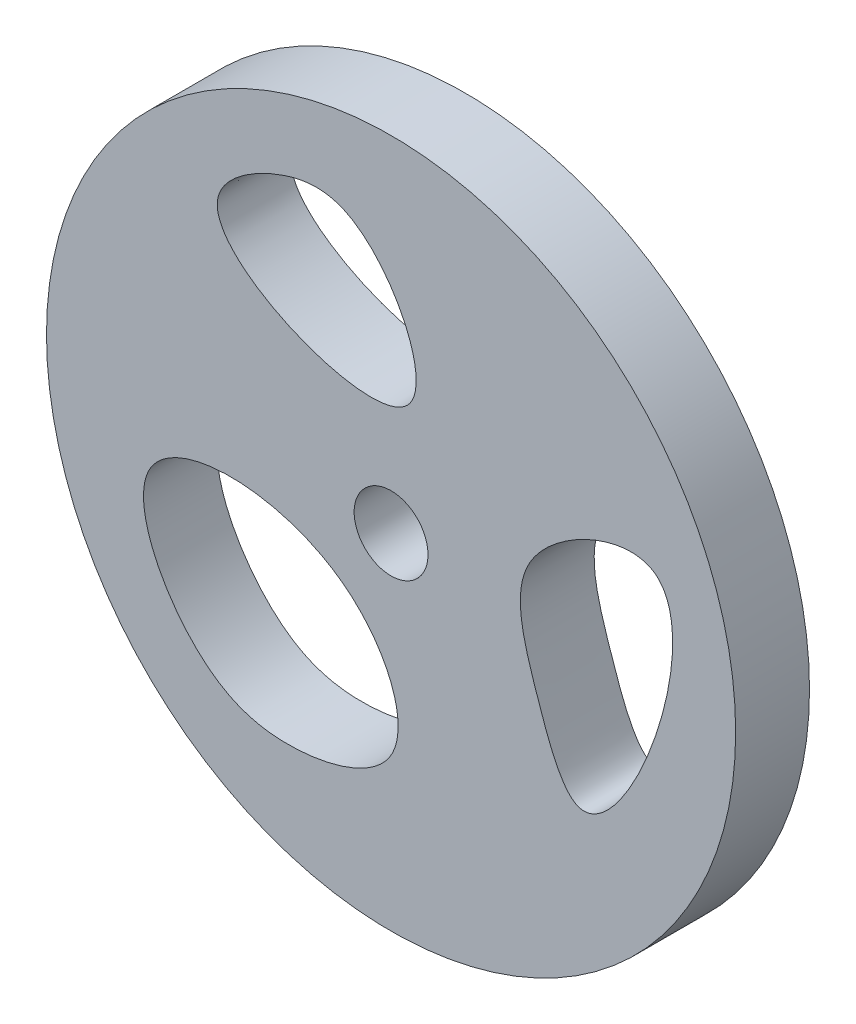
ISO-10303-21;
HEADER;
FILE_DESCRIPTION(('STEP AP214'),'2;1');
FILE_NAME('part.step','',(''),(''),'','','');
FILE_SCHEMA(('AUTOMOTIVE_DESIGN { 1 0 10303 214 1 1 1 1 }'));
ENDSEC;
DATA;
#1=APPLICATION_CONTEXT('core data for automotive mechanical design processes');
#2=APPLICATION_PROTOCOL_DEFINITION('international standard','automotive_design',2000,#1);
#3=PRODUCT_CONTEXT('',#1,'mechanical');
#4=PRODUCT('Part','Part','',(#3));
#5=PRODUCT_RELATED_PRODUCT_CATEGORY('part','',(#4));
#6=PRODUCT_DEFINITION_FORMATION('','',#4);
#7=PRODUCT_DEFINITION_CONTEXT('part definition',#1,'design');
#8=PRODUCT_DEFINITION('design','',#6,#7);
#9=PRODUCT_DEFINITION_SHAPE('','',#8);
#10=(LENGTH_UNIT() NAMED_UNIT(*) SI_UNIT(.MILLI.,.METRE.));
#11=(NAMED_UNIT(*) PLANE_ANGLE_UNIT() SI_UNIT($,.RADIAN.));
#12=(NAMED_UNIT(*) SI_UNIT($,.STERADIAN.) SOLID_ANGLE_UNIT());
#13=UNCERTAINTY_MEASURE_WITH_UNIT(LENGTH_MEASURE(1.E-05),#10,'distance_accuracy_value','');
#14=(GEOMETRIC_REPRESENTATION_CONTEXT(3) GLOBAL_UNCERTAINTY_ASSIGNED_CONTEXT((#13)) GLOBAL_UNIT_ASSIGNED_CONTEXT((#10,
#11,#12)) REPRESENTATION_CONTEXT('',''));
#15=CARTESIAN_POINT('',(0.,0.,0.));
#16=DIRECTION('',(0.,0.,1.));
#17=DIRECTION('',(1.,0.,0.));
#18=AXIS2_PLACEMENT_3D('',#15,#16,#17);
#19=CARTESIAN_POINT('',(-1.24613143731576,-2.4276660944202,24.0005031594472));
#20=DIRECTION('',(0.,0.,1.));
#21=DIRECTION('',(1.,0.,0.));
#22=AXIS2_PLACEMENT_3D('',#19,#20,#21);
#23=PLANE('',#22);
#24=CARTESIAN_POINT('',(-139.433181797028,-41.2046445116864,24.0005031594472));
#25=CARTESIAN_POINT('',(-149.994161996427,-64.3151862714933,24.0005031594472));
#26=CARTESIAN_POINT('',(-116.966744713604,-124.5967057877,24.0005031594472));
#27=CARTESIAN_POINT('',(-55.692370103751,-140.744086820099,24.0005031594472));
#28=CARTESIAN_POINT('',(21.3017568928945,-119.829199606839,24.0005031594472));
#29=CARTESIAN_POINT('',(-22.6836745113519,-13.0135413415076,24.0005031594472));
#30=CARTESIAN_POINT('',(-126.657861366658,-13.2484727618535,24.0005031594472));
#31=CARTESIAN_POINT('',(-139.433181797028,-41.2046445116864,24.0005031594472));
#32=B_SPLINE_CURVE_WITH_KNOTS('',3,(#24,#25,#26,#27,#28,#29,#30,#31),.UNSPECIFIED.,.T.,.F.,(4,1,
1,1,1,4),(0.,0.239927974387723,0.343384517625706,0.513257855397015,0.709765883929295,1.),.UNSPECIFIED.);
#33=CARTESIAN_POINT('',(-139.433181797028,-41.2046445116864,24.0005031594472));
#34=VERTEX_POINT('',#33);
#35=EDGE_CURVE('E65',#34,#34,#32,.T.);
#36=ORIENTED_EDGE('',*,*,#35,.F.);
#37=EDGE_LOOP('',(#36));
#38=FACE_BOUND('',#37,.T.);
#39=CARTESIAN_POINT('',(-1.24613143731576,-2.4276660944202,24.0005031594472));
#40=DIRECTION('',(0.,0.,1.));
#41=DIRECTION('',(1.,0.,0.));
#42=AXIS2_PLACEMENT_3D('',#39,#40,#41);
#43=CIRCLE('',#42,21.);
#44=CARTESIAN_POINT('',(19.7538685626842,-2.4276660944202,24.0005031594472));
#45=VERTEX_POINT('',#44);
#46=EDGE_CURVE('E49',#45,#45,#43,.T.);
#47=ORIENTED_EDGE('',*,*,#46,.F.);
#48=EDGE_LOOP('',(#47));
#49=FACE_BOUND('',#48,.T.);
#50=CARTESIAN_POINT('',(-1.24613143731576,-2.4276660944202,24.0005031594472));
#51=DIRECTION('',(0.,0.,1.));
#52=DIRECTION('',(1.,0.,0.));
#53=AXIS2_PLACEMENT_3D('',#50,#51,#52);
#54=CIRCLE('',#53,196.);
#55=CARTESIAN_POINT('',(194.753868562684,-2.4276660944202,24.0005031594472));
#56=VERTEX_POINT('',#55);
#57=EDGE_CURVE('E10',#56,#56,#54,.T.);
#58=ORIENTED_EDGE('',*,*,#57,.T.);
#59=EDGE_LOOP('',(#58));
#60=FACE_BOUND('',#59,.T.);
#61=CARTESIAN_POINT('',(-61.8792249624956,143.514779948745,24.0005031594472));
#62=CARTESIAN_POINT('',(-79.186551992522,137.811286734839,24.0005031594472));
#63=CARTESIAN_POINT('',(-143.331388537893,96.4885523439587,24.0005031594472));
#64=CARTESIAN_POINT('',(56.2735263084702,15.5704714193278,24.0005031594472));
#65=CARTESIAN_POINT('',(-10.3617333875224,150.542872956365,24.0005031594472));
#66=CARTESIAN_POINT('',(-49.9527845896374,147.445044374595,24.0005031594472));
#67=CARTESIAN_POINT('',(-61.8792249624956,143.514779948745,24.0005031594472));
#68=B_SPLINE_CURVE_WITH_KNOTS('',3,(#61,#62,#63,#64,#65,#66,#67),.UNSPECIFIED.,.T.,.F.,(4,1,1,1,
4),(0.,0.171198278631657,0.582988164100116,0.882027648839468,1.),.UNSPECIFIED.);
#69=CARTESIAN_POINT('',(-61.8792249624956,143.514779948745,24.0005031594472));
#70=VERTEX_POINT('',#69);
#71=EDGE_CURVE('E55',#70,#70,#68,.T.);
#72=ORIENTED_EDGE('',*,*,#71,.F.);
#73=EDGE_LOOP('',(#72));
#74=FACE_BOUND('',#73,.T.);
#75=CARTESIAN_POINT('',(148.221494461965,53.2701756321986,24.0005031594472));
#76=CARTESIAN_POINT('',(131.507299926172,64.3295465026712,24.0005031594472));
#77=CARTESIAN_POINT('',(59.0576414772064,30.7257981379264,24.0005031594472));
#78=CARTESIAN_POINT('',(78.3099850439555,-31.9013091478238,24.0005031594472));
#79=CARTESIAN_POINT('',(116.403289468822,-138.864569313652,24.0005031594472));
#80=CARTESIAN_POINT('',(180.381660063077,31.9905861265931,24.0005031594472));
#81=CARTESIAN_POINT('',(148.221494461965,53.2701756321986,24.0005031594472));
#82=B_SPLINE_CURVE_WITH_KNOTS('',3,(#75,#76,#77,#78,#79,#80,#81),.UNSPECIFIED.,.T.,.F.,(4,1,1,1,
4),(0.,0.224446261208132,0.423947927755001,0.56813779368511,1.),.UNSPECIFIED.);
#83=CARTESIAN_POINT('',(148.221494461965,53.2701756321986,24.0005031594472));
#84=VERTEX_POINT('',#83);
#85=EDGE_CURVE('E117',#84,#84,#82,.T.);
#86=ORIENTED_EDGE('',*,*,#85,.F.);
#87=EDGE_LOOP('',(#86));
#88=FACE_BOUND('',#87,.T.);
#89=ADVANCED_FACE('F36',(#38,#49,#60,#74,#88),#23,.T.);
#90=CARTESIAN_POINT('',(-1.24613143731576,-2.4276660944202,-17.9994968405528));
#91=DIRECTION('',(0.,0.,1.));
#92=DIRECTION('',(1.,0.,0.));
#93=AXIS2_PLACEMENT_3D('',#90,#91,#92);
#94=PLANE('',#93);
#95=CARTESIAN_POINT('',(-1.24613143731576,-2.4276660944202,-17.9994968405528));
#96=DIRECTION('',(0.,0.,1.));
#97=DIRECTION('',(1.,0.,0.));
#98=AXIS2_PLACEMENT_3D('',#95,#96,#97);
#99=CIRCLE('',#98,196.);
#100=CARTESIAN_POINT('',(194.753868562684,-2.4276660944202,-17.9994968405528));
#101=VERTEX_POINT('',#100);
#102=EDGE_CURVE('E40',#101,#101,#99,.T.);
#103=ORIENTED_EDGE('',*,*,#102,.F.);
#104=EDGE_LOOP('',(#103));
#105=FACE_BOUND('',#104,.T.);
#106=CARTESIAN_POINT('',(-1.24613143731576,-2.4276660944202,-17.9994968405528));
#107=DIRECTION('',(0.,0.,1.));
#108=DIRECTION('',(1.,0.,0.));
#109=AXIS2_PLACEMENT_3D('',#106,#107,#108);
#110=CIRCLE('',#109,21.);
#111=CARTESIAN_POINT('',(19.7538685626842,-2.4276660944202,-17.9994968405528));
#112=VERTEX_POINT('',#111);
#113=EDGE_CURVE('E51',#112,#112,#110,.T.);
#114=ORIENTED_EDGE('',*,*,#113,.T.);
#115=EDGE_LOOP('',(#114));
#116=FACE_BOUND('',#115,.T.);
#117=CARTESIAN_POINT('',(-61.8792249624956,143.514779948745,-17.9994968405528));
#118=CARTESIAN_POINT('',(-79.186551992522,137.811286734839,-17.9994968405528));
#119=CARTESIAN_POINT('',(-143.331388537893,96.4885523439587,-17.9994968405528));
#120=CARTESIAN_POINT('',(56.2735263084702,15.5704714193278,-17.9994968405528));
#121=CARTESIAN_POINT('',(-10.3617333875224,150.542872956365,-17.9994968405528));
#122=CARTESIAN_POINT('',(-49.9527845896374,147.445044374595,-17.9994968405528));
#123=CARTESIAN_POINT('',(-61.8792249624956,143.514779948745,-17.9994968405528));
#124=B_SPLINE_CURVE_WITH_KNOTS('',3,(#117,#118,#119,#120,#121,#122,#123),.UNSPECIFIED.,.T.,.F.,
(4,1,1,1,4),(0.,0.171198278631657,0.582988164100116,0.882027648839468,1.),.UNSPECIFIED.);
#125=CARTESIAN_POINT('',(-61.8792249624956,143.514779948745,-17.9994968405528));
#126=VERTEX_POINT('',#125);
#127=EDGE_CURVE('E59',#126,#126,#124,.T.);
#128=ORIENTED_EDGE('',*,*,#127,.T.);
#129=EDGE_LOOP('',(#128));
#130=FACE_BOUND('',#129,.T.);
#131=CARTESIAN_POINT('',(-139.433181797028,-41.2046445116864,-17.9994968405528));
#132=CARTESIAN_POINT('',(-149.994161996427,-64.3151862714933,-17.9994968405528));
#133=CARTESIAN_POINT('',(-116.966744713604,-124.5967057877,-17.9994968405528));
#134=CARTESIAN_POINT('',(-55.692370103751,-140.744086820099,-17.9994968405528));
#135=CARTESIAN_POINT('',(21.3017568928945,-119.829199606839,-17.9994968405528));
#136=CARTESIAN_POINT('',(-22.6836745113519,-13.0135413415076,-17.9994968405528));
#137=CARTESIAN_POINT('',(-126.657861366658,-13.2484727618535,-17.9994968405528));
#138=CARTESIAN_POINT('',(-139.433181797028,-41.2046445116864,-17.9994968405528));
#139=B_SPLINE_CURVE_WITH_KNOTS('',3,(#131,#132,#133,#134,#135,#136,#137,#138),.UNSPECIFIED.,.T.,
.F.,(4,1,1,1,1,4),(0.,0.239927974387723,0.343384517625706,0.513257855397015,0.709765883929295,
1.),.UNSPECIFIED.);
#140=CARTESIAN_POINT('',(-139.433181797028,-41.2046445116864,-17.9994968405528));
#141=VERTEX_POINT('',#140);
#142=EDGE_CURVE('E75',#141,#141,#139,.T.);
#143=ORIENTED_EDGE('',*,*,#142,.T.);
#144=EDGE_LOOP('',(#143));
#145=FACE_BOUND('',#144,.T.);
#146=CARTESIAN_POINT('',(148.221494461965,53.2701756321986,-17.9994968405528));
#147=CARTESIAN_POINT('',(131.507299926172,64.3295465026712,-17.9994968405528));
#148=CARTESIAN_POINT('',(59.0576414772064,30.7257981379264,-17.9994968405528));
#149=CARTESIAN_POINT('',(78.3099850439555,-31.9013091478238,-17.9994968405528));
#150=CARTESIAN_POINT('',(116.403289468822,-138.864569313652,-17.9994968405528));
#151=CARTESIAN_POINT('',(180.381660063077,31.9905861265931,-17.9994968405528));
#152=CARTESIAN_POINT('',(148.221494461965,53.2701756321986,-17.9994968405528));
#153=B_SPLINE_CURVE_WITH_KNOTS('',3,(#146,#147,#148,#149,#150,#151,#152),.UNSPECIFIED.,.T.,.F.,
(4,1,1,1,4),(0.,0.224446261208132,0.423947927755001,0.56813779368511,1.),.UNSPECIFIED.);
#154=CARTESIAN_POINT('',(148.221494461965,53.2701756321986,-17.9994968405528));
#155=VERTEX_POINT('',#154);
#156=EDGE_CURVE('E114',#155,#155,#153,.T.);
#157=ORIENTED_EDGE('',*,*,#156,.T.);
#158=EDGE_LOOP('',(#157));
#159=FACE_BOUND('',#158,.T.);
#160=ADVANCED_FACE('F95',(#105,#116,#130,#145,#159),#94,.F.);
#161=CARTESIAN_POINT('',(-1.24613143731576,-2.4276660944202,24.0005031594472));
#162=DIRECTION('',(0.,0.,-1.));
#163=DIRECTION('',(-1.,0.,0.));
#164=AXIS2_PLACEMENT_3D('',#161,#162,#163);
#165=CYLINDRICAL_SURFACE('',#164,196.);
#166=ORIENTED_EDGE('',*,*,#57,.F.);
#167=EDGE_LOOP('',(#166));
#168=FACE_BOUND('',#167,.T.);
#169=ORIENTED_EDGE('',*,*,#102,.T.);
#170=EDGE_LOOP('',(#169));
#171=FACE_BOUND('',#170,.T.);
#172=ADVANCED_FACE('F38',(#168,#171),#165,.T.);
#173=CARTESIAN_POINT('',(-1.24613143731576,-2.4276660944202,24.0005031594472));
#174=DIRECTION('',(0.,0.,-1.));
#175=DIRECTION('',(-1.,0.,0.));
#176=AXIS2_PLACEMENT_3D('',#173,#174,#175);
#177=CYLINDRICAL_SURFACE('',#176,21.);
#178=ORIENTED_EDGE('',*,*,#46,.T.);
#179=EDGE_LOOP('',(#178));
#180=FACE_BOUND('',#179,.T.);
#181=ORIENTED_EDGE('',*,*,#113,.F.);
#182=EDGE_LOOP('',(#181));
#183=FACE_BOUND('',#182,.T.);
#184=ADVANCED_FACE('F88',(#180,#183),#177,.F.);
#185=DIRECTION('',(0.,0.,-1.));
#186=VECTOR('',#185,1.);
#187=SURFACE_OF_LINEAR_EXTRUSION('',#68,#186);
#188=ORIENTED_EDGE('',*,*,#71,.T.);
#189=EDGE_LOOP('',(#188));
#190=FACE_BOUND('',#189,.T.);
#191=ORIENTED_EDGE('',*,*,#127,.F.);
#192=EDGE_LOOP('',(#191));
#193=FACE_BOUND('',#192,.T.);
#194=ADVANCED_FACE('F83',(#190,#193),#187,.T.);
#195=DIRECTION('',(0.,0.,-1.));
#196=VECTOR('',#195,1.);
#197=SURFACE_OF_LINEAR_EXTRUSION('',#32,#196);
#198=ORIENTED_EDGE('',*,*,#35,.T.);
#199=EDGE_LOOP('',(#198));
#200=FACE_BOUND('',#199,.T.);
#201=ORIENTED_EDGE('',*,*,#142,.F.);
#202=EDGE_LOOP('',(#201));
#203=FACE_BOUND('',#202,.T.);
#204=ADVANCED_FACE('F87',(#200,#203),#197,.T.);
#205=DIRECTION('',(0.,0.,-1.));
#206=VECTOR('',#205,1.);
#207=SURFACE_OF_LINEAR_EXTRUSION('',#82,#206);
#208=ORIENTED_EDGE('',*,*,#85,.T.);
#209=EDGE_LOOP('',(#208));
#210=FACE_BOUND('',#209,.T.);
#211=ORIENTED_EDGE('',*,*,#156,.F.);
#212=EDGE_LOOP('',(#211));
#213=FACE_BOUND('',#212,.T.);
#214=ADVANCED_FACE('F149',(#210,#213),#207,.T.);
#215=CLOSED_SHELL('',(#89,#160,#172,#184,#194,#204,#214));
#216=MANIFOLD_SOLID_BREP('B2',#215);
#217=ADVANCED_BREP_SHAPE_REPRESENTATION('',(#18,#216),#14);
#218=SHAPE_DEFINITION_REPRESENTATION(#9,#217);
ENDSEC;
END-ISO-10303-21;
